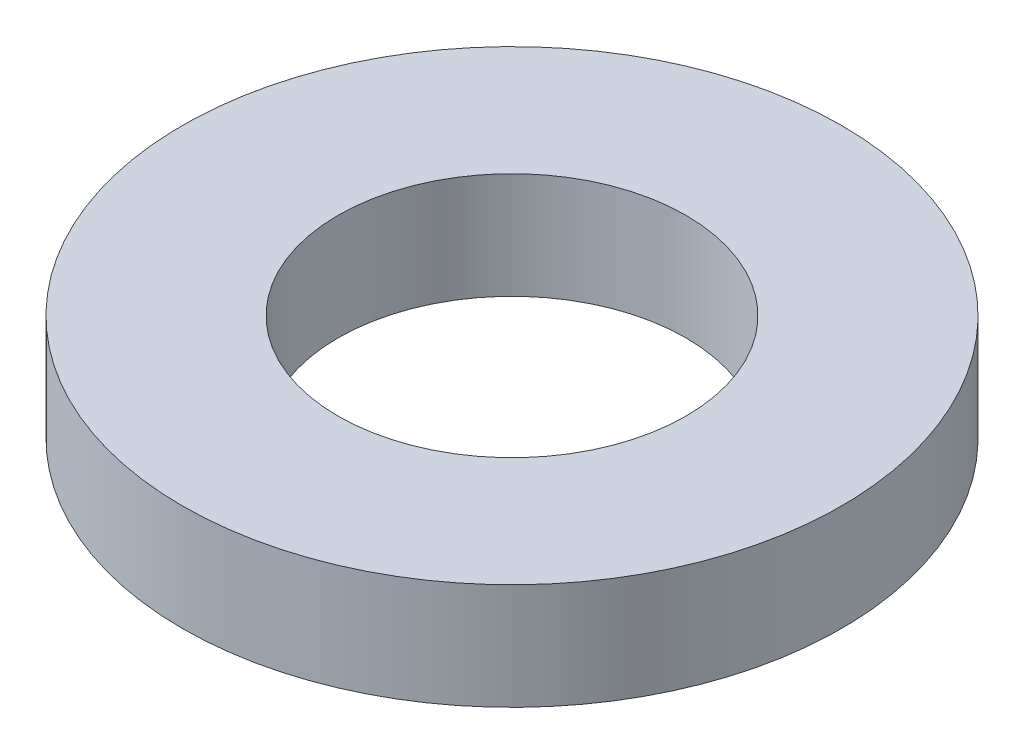
ISO-10303-21;
HEADER;
FILE_DESCRIPTION(('STEP AP214'),'2;1');
FILE_NAME('part.step','',(''),(''),'','','');
FILE_SCHEMA(('AUTOMOTIVE_DESIGN { 1 0 10303 214 1 1 1 1 }'));
ENDSEC;
DATA;
#1=APPLICATION_CONTEXT('core data for automotive mechanical design processes');
#2=APPLICATION_PROTOCOL_DEFINITION('international standard','automotive_design',2000,#1);
#3=PRODUCT_CONTEXT('',#1,'mechanical');
#4=PRODUCT('Part','Part','',(#3));
#5=PRODUCT_RELATED_PRODUCT_CATEGORY('part','',(#4));
#6=PRODUCT_DEFINITION_FORMATION('','',#4);
#7=PRODUCT_DEFINITION_CONTEXT('part definition',#1,'design');
#8=PRODUCT_DEFINITION('design','',#6,#7);
#9=PRODUCT_DEFINITION_SHAPE('','',#8);
#10=(LENGTH_UNIT() NAMED_UNIT(*) SI_UNIT(.MILLI.,.METRE.));
#11=(NAMED_UNIT(*) PLANE_ANGLE_UNIT() SI_UNIT($,.RADIAN.));
#12=(NAMED_UNIT(*) SI_UNIT($,.STERADIAN.) SOLID_ANGLE_UNIT());
#13=UNCERTAINTY_MEASURE_WITH_UNIT(LENGTH_MEASURE(1.E-05),#10,'distance_accuracy_value','');
#14=(GEOMETRIC_REPRESENTATION_CONTEXT(3) GLOBAL_UNCERTAINTY_ASSIGNED_CONTEXT((#13)) GLOBAL_UNIT_ASSIGNED_CONTEXT((#10,
#11,#12)) REPRESENTATION_CONTEXT('',''));
#15=CARTESIAN_POINT('',(0.,0.,0.));
#16=DIRECTION('',(0.,0.,1.));
#17=DIRECTION('',(1.,0.,0.));
#18=AXIS2_PLACEMENT_3D('',#15,#16,#17);
#19=CARTESIAN_POINT('',(0.,29.,0.));
#20=DIRECTION('',(0.,-1.,0.));
#21=DIRECTION('',(0.,0.,-1.));
#22=AXIS2_PLACEMENT_3D('',#19,#20,#21);
#23=CYLINDRICAL_SURFACE('',#22,90.);
#24=CARTESIAN_POINT('',(0.,29.,0.));
#25=DIRECTION('',(0.,1.,0.));
#26=DIRECTION('',(0.,0.,1.));
#27=AXIS2_PLACEMENT_3D('',#24,#25,#26);
#28=CIRCLE('',#27,90.);
#29=CARTESIAN_POINT('',(0.,29.,-90.));
#30=VERTEX_POINT('',#29);
#31=EDGE_CURVE('E10',#30,#30,#28,.T.);
#32=CARTESIAN_POINT('',(0.,0.,0.));
#33=DIRECTION('',(0.,1.,0.));
#34=DIRECTION('',(0.,0.,1.));
#35=AXIS2_PLACEMENT_3D('',#32,#33,#34);
#36=CIRCLE('',#35,90.);
#37=CARTESIAN_POINT('',(0.,0.,-90.));
#38=VERTEX_POINT('',#37);
#39=EDGE_CURVE('E37',#38,#38,#36,.T.);
#40=CARTESIAN_POINT('',(0.,29.,-90.));
#41=CARTESIAN_POINT('',(0.,28.6979166666667,-90.));
#42=CARTESIAN_POINT('',(0.,28.3958333333333,-90.));
#43=CARTESIAN_POINT('',(0.,27.7916666666667,-90.));
#44=CARTESIAN_POINT('',(0.,27.4895833333333,-90.));
#45=CARTESIAN_POINT('',(0.,26.8854166666667,-90.));
#46=CARTESIAN_POINT('',(0.,26.5833333333333,-90.));
#47=CARTESIAN_POINT('',(0.,25.9791666666667,-90.));
#48=CARTESIAN_POINT('',(0.,25.6770833333333,-90.));
#49=CARTESIAN_POINT('',(0.,25.0729166666667,-90.));
#50=CARTESIAN_POINT('',(0.,24.7708333333333,-90.));
#51=CARTESIAN_POINT('',(0.,24.1666666666667,-90.));
#52=CARTESIAN_POINT('',(0.,23.8645833333333,-90.));
#53=CARTESIAN_POINT('',(0.,23.2604166666667,-90.));
#54=CARTESIAN_POINT('',(0.,22.9583333333333,-90.));
#55=CARTESIAN_POINT('',(0.,22.3541666666667,-90.));
#56=CARTESIAN_POINT('',(0.,22.0520833333333,-90.));
#57=CARTESIAN_POINT('',(0.,21.4479166666667,-90.));
#58=CARTESIAN_POINT('',(0.,21.1458333333333,-90.));
#59=CARTESIAN_POINT('',(0.,20.5416666666667,-90.));
#60=CARTESIAN_POINT('',(0.,20.2395833333333,-90.));
#61=CARTESIAN_POINT('',(0.,19.6354166666667,-90.));
#62=CARTESIAN_POINT('',(0.,19.3333333333333,-90.));
#63=CARTESIAN_POINT('',(0.,18.7291666666667,-90.));
#64=CARTESIAN_POINT('',(0.,18.4270833333333,-90.));
#65=CARTESIAN_POINT('',(0.,17.8229166666667,-90.));
#66=CARTESIAN_POINT('',(0.,17.5208333333333,-90.));
#67=CARTESIAN_POINT('',(0.,16.9166666666667,-90.));
#68=CARTESIAN_POINT('',(0.,16.6145833333333,-90.));
#69=CARTESIAN_POINT('',(0.,16.0104166666667,-90.));
#70=CARTESIAN_POINT('',(0.,15.7083333333333,-90.));
#71=CARTESIAN_POINT('',(0.,15.1041666666667,-90.));
#72=CARTESIAN_POINT('',(0.,14.8020833333333,-90.));
#73=CARTESIAN_POINT('',(0.,14.1979166666667,-90.));
#74=CARTESIAN_POINT('',(0.,13.8958333333333,-90.));
#75=CARTESIAN_POINT('',(0.,13.2916666666667,-90.));
#76=CARTESIAN_POINT('',(0.,12.9895833333333,-90.));
#77=CARTESIAN_POINT('',(0.,12.3854166666667,-90.));
#78=CARTESIAN_POINT('',(0.,12.0833333333333,-90.));
#79=CARTESIAN_POINT('',(0.,11.4791666666667,-90.));
#80=CARTESIAN_POINT('',(0.,11.1770833333333,-90.));
#81=CARTESIAN_POINT('',(0.,10.5729166666667,-90.));
#82=CARTESIAN_POINT('',(0.,10.2708333333333,-90.));
#83=CARTESIAN_POINT('',(0.,9.66666666666667,-90.));
#84=CARTESIAN_POINT('',(0.,9.36458333333333,-90.));
#85=CARTESIAN_POINT('',(0.,8.76041666666667,-90.));
#86=CARTESIAN_POINT('',(0.,8.45833333333333,-90.));
#87=CARTESIAN_POINT('',(0.,7.85416666666667,-90.));
#88=CARTESIAN_POINT('',(0.,7.55208333333333,-90.));
#89=CARTESIAN_POINT('',(0.,6.94791666666667,-90.));
#90=CARTESIAN_POINT('',(0.,6.64583333333333,-90.));
#91=CARTESIAN_POINT('',(0.,6.04166666666667,-90.));
#92=CARTESIAN_POINT('',(0.,5.73958333333333,-90.));
#93=CARTESIAN_POINT('',(0.,5.13541666666667,-90.));
#94=CARTESIAN_POINT('',(0.,4.83333333333333,-90.));
#95=CARTESIAN_POINT('',(0.,4.22916666666667,-90.));
#96=CARTESIAN_POINT('',(0.,3.92708333333333,-90.));
#97=CARTESIAN_POINT('',(0.,3.32291666666667,-90.));
#98=CARTESIAN_POINT('',(0.,3.02083333333333,-90.));
#99=CARTESIAN_POINT('',(0.,2.41666666666667,-90.));
#100=CARTESIAN_POINT('',(0.,2.11458333333333,-90.));
#101=CARTESIAN_POINT('',(0.,1.51041666666667,-90.));
#102=CARTESIAN_POINT('',(0.,1.20833333333333,-90.));
#103=CARTESIAN_POINT('',(0.,0.604166666666667,-90.));
#104=CARTESIAN_POINT('',(0.,0.302083333333333,-90.));
#105=CARTESIAN_POINT('',(0.,0.,-90.));
#106=B_SPLINE_CURVE_WITH_KNOTS('',3,(#40,#41,#42,#43,#44,#45,#46,#47,#48,#49,#50,#51,#52,#53,
#54,#55,#56,#57,#58,#59,#60,#61,#62,#63,#64,#65,#66,#67,#68,#69,#70,#71,#72,#73,#74,#75,#76,#77,
#78,#79,#80,#81,#82,#83,#84,#85,#86,#87,#88,#89,#90,#91,#92,#93,#94,#95,#96,#97,#98,#99,#100,
#101,#102,#103,#104,#105),.UNSPECIFIED.,.F.,.F.,(4,2,2,2,2,2,2,2,2,2,2,2,2,2,2,2,2,2,2,2,2,2,2,
2,2,2,2,2,2,2,2,2,4),(0.,0.906250000000001,1.8125,2.71875,3.625,4.53125,5.4375,6.34375,7.25,
8.15625,9.0625,9.96875,10.875,11.78125,12.6875,13.59375,14.5,15.40625,16.3125,17.21875,18.125,
19.03125,19.9375,20.84375,21.75,22.65625,23.5625,24.46875,25.375,26.28125,27.1875,28.09375,29.),.UNSPECIFIED.);
#107=EDGE_CURVE('BSEAM40',#30,#38,#106,.T.);
#108=ORIENTED_EDGE('',*,*,#31,.F.);
#109=ORIENTED_EDGE('',*,*,#39,.T.);
#110=ORIENTED_EDGE('',*,*,#107,.T.);
#111=ORIENTED_EDGE('',*,*,#107,.F.);
#112=EDGE_LOOP('',(#108,#110,#109,#111));
#113=FACE_BOUND('',#112,.T.);
#114=ADVANCED_FACE('F40',(#113),#23,.T.);
#115=CARTESIAN_POINT('',(0.,29.,0.));
#116=DIRECTION('',(0.,1.,0.));
#117=DIRECTION('',(0.,0.,1.));
#118=AXIS2_PLACEMENT_3D('',#115,#116,#117);
#119=PLANE('',#118);
#120=CARTESIAN_POINT('',(0.,29.,0.));
#121=DIRECTION('',(0.,1.,0.));
#122=DIRECTION('',(0.,0.,1.));
#123=AXIS2_PLACEMENT_3D('',#120,#121,#122);
#124=CIRCLE('',#123,47.5);
#125=CARTESIAN_POINT('',(0.,29.,-47.5));
#126=VERTEX_POINT('',#125);
#127=EDGE_CURVE('E50',#126,#126,#124,.T.);
#128=ORIENTED_EDGE('',*,*,#127,.F.);
#129=EDGE_LOOP('',(#128));
#130=FACE_BOUND('',#129,.T.);
#131=ORIENTED_EDGE('',*,*,#31,.T.);
#132=EDGE_LOOP('',(#131));
#133=FACE_BOUND('',#132,.T.);
#134=ADVANCED_FACE('F59',(#130,#133),#119,.T.);
#135=CARTESIAN_POINT('',(0.,0.,0.));
#136=DIRECTION('',(0.,1.,0.));
#137=DIRECTION('',(0.,0.,1.));
#138=AXIS2_PLACEMENT_3D('',#135,#136,#137);
#139=PLANE('',#138);
#140=CARTESIAN_POINT('',(0.,0.,0.));
#141=DIRECTION('',(0.,1.,0.));
#142=DIRECTION('',(0.,0.,1.));
#143=AXIS2_PLACEMENT_3D('',#140,#141,#142);
#144=CIRCLE('',#143,47.5);
#145=CARTESIAN_POINT('',(0.,0.,-47.5));
#146=VERTEX_POINT('',#145);
#147=EDGE_CURVE('E47',#146,#146,#144,.T.);
#148=ORIENTED_EDGE('',*,*,#147,.T.);
#149=EDGE_LOOP('',(#148));
#150=FACE_BOUND('',#149,.T.);
#151=ORIENTED_EDGE('',*,*,#39,.F.);
#152=EDGE_LOOP('',(#151));
#153=FACE_BOUND('',#152,.T.);
#154=ADVANCED_FACE('F58',(#150,#153),#139,.F.);
#155=CARTESIAN_POINT('',(0.,29.,0.));
#156=DIRECTION('',(0.,-1.,0.));
#157=DIRECTION('',(0.,0.,-1.));
#158=AXIS2_PLACEMENT_3D('',#155,#156,#157);
#159=CYLINDRICAL_SURFACE('',#158,47.5);
#160=CARTESIAN_POINT('',(0.,29.,-47.5));
#161=CARTESIAN_POINT('',(0.,28.6979166666667,-47.5));
#162=CARTESIAN_POINT('',(0.,28.3958333333333,-47.5));
#163=CARTESIAN_POINT('',(0.,27.7916666666667,-47.5));
#164=CARTESIAN_POINT('',(0.,27.4895833333333,-47.5));
#165=CARTESIAN_POINT('',(0.,26.8854166666667,-47.5));
#166=CARTESIAN_POINT('',(0.,26.5833333333333,-47.5));
#167=CARTESIAN_POINT('',(0.,25.9791666666667,-47.5));
#168=CARTESIAN_POINT('',(0.,25.6770833333333,-47.5));
#169=CARTESIAN_POINT('',(0.,25.0729166666667,-47.5));
#170=CARTESIAN_POINT('',(0.,24.7708333333333,-47.5));
#171=CARTESIAN_POINT('',(0.,24.1666666666667,-47.5));
#172=CARTESIAN_POINT('',(0.,23.8645833333333,-47.5));
#173=CARTESIAN_POINT('',(0.,23.2604166666667,-47.5));
#174=CARTESIAN_POINT('',(0.,22.9583333333333,-47.5));
#175=CARTESIAN_POINT('',(0.,22.3541666666667,-47.5));
#176=CARTESIAN_POINT('',(0.,22.0520833333333,-47.5));
#177=CARTESIAN_POINT('',(0.,21.4479166666667,-47.5));
#178=CARTESIAN_POINT('',(0.,21.1458333333333,-47.5));
#179=CARTESIAN_POINT('',(0.,20.5416666666667,-47.5));
#180=CARTESIAN_POINT('',(0.,20.2395833333333,-47.5));
#181=CARTESIAN_POINT('',(0.,19.6354166666667,-47.5));
#182=CARTESIAN_POINT('',(0.,19.3333333333333,-47.5));
#183=CARTESIAN_POINT('',(0.,18.7291666666667,-47.5));
#184=CARTESIAN_POINT('',(0.,18.4270833333333,-47.5));
#185=CARTESIAN_POINT('',(0.,17.8229166666667,-47.5));
#186=CARTESIAN_POINT('',(0.,17.5208333333333,-47.5));
#187=CARTESIAN_POINT('',(0.,16.9166666666667,-47.5));
#188=CARTESIAN_POINT('',(0.,16.6145833333333,-47.5));
#189=CARTESIAN_POINT('',(0.,16.0104166666667,-47.5));
#190=CARTESIAN_POINT('',(0.,15.7083333333333,-47.5));
#191=CARTESIAN_POINT('',(0.,15.1041666666667,-47.5));
#192=CARTESIAN_POINT('',(0.,14.8020833333333,-47.5));
#193=CARTESIAN_POINT('',(0.,14.1979166666667,-47.5));
#194=CARTESIAN_POINT('',(0.,13.8958333333333,-47.5));
#195=CARTESIAN_POINT('',(0.,13.2916666666667,-47.5));
#196=CARTESIAN_POINT('',(0.,12.9895833333333,-47.5));
#197=CARTESIAN_POINT('',(0.,12.3854166666667,-47.5));
#198=CARTESIAN_POINT('',(0.,12.0833333333333,-47.5));
#199=CARTESIAN_POINT('',(0.,11.4791666666667,-47.5));
#200=CARTESIAN_POINT('',(0.,11.1770833333333,-47.5));
#201=CARTESIAN_POINT('',(0.,10.5729166666667,-47.5));
#202=CARTESIAN_POINT('',(0.,10.2708333333333,-47.5));
#203=CARTESIAN_POINT('',(0.,9.66666666666667,-47.5));
#204=CARTESIAN_POINT('',(0.,9.36458333333333,-47.5));
#205=CARTESIAN_POINT('',(0.,8.76041666666667,-47.5));
#206=CARTESIAN_POINT('',(0.,8.45833333333333,-47.5));
#207=CARTESIAN_POINT('',(0.,7.85416666666667,-47.5));
#208=CARTESIAN_POINT('',(0.,7.55208333333333,-47.5));
#209=CARTESIAN_POINT('',(0.,6.94791666666667,-47.5));
#210=CARTESIAN_POINT('',(0.,6.64583333333333,-47.5));
#211=CARTESIAN_POINT('',(0.,6.04166666666667,-47.5));
#212=CARTESIAN_POINT('',(0.,5.73958333333333,-47.5));
#213=CARTESIAN_POINT('',(0.,5.13541666666667,-47.5));
#214=CARTESIAN_POINT('',(0.,4.83333333333333,-47.5));
#215=CARTESIAN_POINT('',(0.,4.22916666666667,-47.5));
#216=CARTESIAN_POINT('',(0.,3.92708333333333,-47.5));
#217=CARTESIAN_POINT('',(0.,3.32291666666667,-47.5));
#218=CARTESIAN_POINT('',(0.,3.02083333333333,-47.5));
#219=CARTESIAN_POINT('',(0.,2.41666666666667,-47.5));
#220=CARTESIAN_POINT('',(0.,2.11458333333333,-47.5));
#221=CARTESIAN_POINT('',(0.,1.51041666666667,-47.5));
#222=CARTESIAN_POINT('',(0.,1.20833333333333,-47.5));
#223=CARTESIAN_POINT('',(0.,0.604166666666667,-47.5));
#224=CARTESIAN_POINT('',(0.,0.302083333333333,-47.5));
#225=CARTESIAN_POINT('',(0.,0.,-47.5));
#226=B_SPLINE_CURVE_WITH_KNOTS('',3,(#160,#161,#162,#163,#164,#165,#166,#167,#168,#169,#170,
#171,#172,#173,#174,#175,#176,#177,#178,#179,#180,#181,#182,#183,#184,#185,#186,#187,#188,#189,
#190,#191,#192,#193,#194,#195,#196,#197,#198,#199,#200,#201,#202,#203,#204,#205,#206,#207,#208,
#209,#210,#211,#212,#213,#214,#215,#216,#217,#218,#219,#220,#221,#222,#223,#224,#225),
.UNSPECIFIED.,.F.,.F.,(4,2,2,2,2,2,2,2,2,2,2,2,2,2,2,2,2,2,2,2,2,2,2,2,2,2,2,2,2,2,2,2,4),(0.,
0.906249999999997,1.8125,2.71875,3.625,4.53125,5.4375,6.34375,7.25,8.15625,9.0625,9.96875,
10.875,11.78125,12.6875,13.59375,14.5,15.40625,16.3125,17.21875,18.125,19.03125,19.9375,
20.84375,21.75,22.65625,23.5625,24.46875,25.375,26.28125,27.1875,28.09375,29.),.UNSPECIFIED.);
#227=EDGE_CURVE('BSEAM54',#126,#146,#226,.T.);
#228=ORIENTED_EDGE('',*,*,#127,.T.);
#229=ORIENTED_EDGE('',*,*,#147,.F.);
#230=ORIENTED_EDGE('',*,*,#227,.T.);
#231=ORIENTED_EDGE('',*,*,#227,.F.);
#232=EDGE_LOOP('',(#228,#230,#229,#231));
#233=FACE_BOUND('',#232,.T.);
#234=ADVANCED_FACE('F54',(#233),#159,.F.);
#235=CLOSED_SHELL('',(#114,#134,#154,#234));
#236=MANIFOLD_SOLID_BREP('B2',#235);
#237=ADVANCED_BREP_SHAPE_REPRESENTATION('',(#18,#236),#14);
#238=SHAPE_DEFINITION_REPRESENTATION(#9,#237);
ENDSEC;
END-ISO-10303-21;
